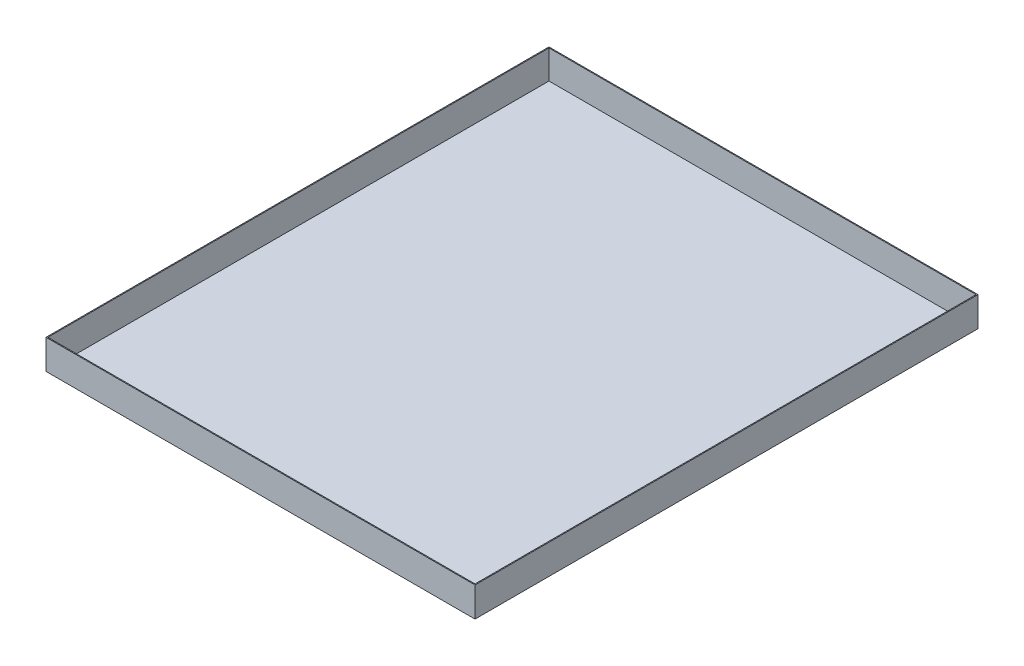
ISO-10303-21;
HEADER;
FILE_DESCRIPTION(('STEP AP214'),'2;1');
FILE_NAME('part.step','',(''),(''),'','','');
FILE_SCHEMA(('AUTOMOTIVE_DESIGN { 1 0 10303 214 1 1 1 1 }'));
ENDSEC;
DATA;
#1=APPLICATION_CONTEXT('core data for automotive mechanical design processes');
#2=APPLICATION_PROTOCOL_DEFINITION('international standard','automotive_design',2000,#1);
#3=PRODUCT_CONTEXT('',#1,'mechanical');
#4=PRODUCT('Part','Part','',(#3));
#5=PRODUCT_RELATED_PRODUCT_CATEGORY('part','',(#4));
#6=PRODUCT_DEFINITION_FORMATION('','',#4);
#7=PRODUCT_DEFINITION_CONTEXT('part definition',#1,'design');
#8=PRODUCT_DEFINITION('design','',#6,#7);
#9=PRODUCT_DEFINITION_SHAPE('','',#8);
#10=(LENGTH_UNIT() NAMED_UNIT(*) SI_UNIT(.MILLI.,.METRE.));
#11=(NAMED_UNIT(*) PLANE_ANGLE_UNIT() SI_UNIT($,.RADIAN.));
#12=(NAMED_UNIT(*) SI_UNIT($,.STERADIAN.) SOLID_ANGLE_UNIT());
#13=UNCERTAINTY_MEASURE_WITH_UNIT(LENGTH_MEASURE(1.E-05),#10,'distance_accuracy_value','');
#14=(GEOMETRIC_REPRESENTATION_CONTEXT(3) GLOBAL_UNCERTAINTY_ASSIGNED_CONTEXT((#13)) GLOBAL_UNIT_ASSIGNED_CONTEXT((#10,
#11,#12)) REPRESENTATION_CONTEXT('',''));
#15=CARTESIAN_POINT('',(0.,0.,0.));
#16=DIRECTION('',(0.,0.,1.));
#17=DIRECTION('',(1.,0.,0.));
#18=AXIS2_PLACEMENT_3D('',#15,#16,#17);
#19=CARTESIAN_POINT('',(0.,50.8,0.));
#20=DIRECTION('',(0.,-1.,0.));
#21=DIRECTION('',(0.,0.,-1.));
#22=AXIS2_PLACEMENT_3D('',#19,#20,#21);
#23=PLANE('',#22);
#24=DIRECTION('',(1.,0.,0.));
#25=VECTOR('',#24,1.);
#26=CARTESIAN_POINT('',(-368.3,50.8,431.8));
#27=LINE('',#26,#25);
#28=CARTESIAN_POINT('',(-368.3,50.8,431.8));
#29=VERTEX_POINT('',#28);
#30=CARTESIAN_POINT('',(368.3,50.8,431.8));
#31=VERTEX_POINT('',#30);
#32=EDGE_CURVE('E89',#29,#31,#27,.T.);
#33=ORIENTED_EDGE('',*,*,#32,.T.);
#34=DIRECTION('',(0.,0.,1.));
#35=VECTOR('',#34,1.);
#36=CARTESIAN_POINT('',(368.3,50.8,-431.8));
#37=LINE('',#36,#35);
#38=CARTESIAN_POINT('',(368.3,50.8,-431.8));
#39=VERTEX_POINT('',#38);
#40=EDGE_CURVE('E167',#39,#31,#37,.T.);
#41=ORIENTED_EDGE('',*,*,#40,.F.);
#42=DIRECTION('',(1.,0.,0.));
#43=VECTOR('',#42,1.);
#44=CARTESIAN_POINT('',(-368.3,50.8,-431.8));
#45=LINE('',#44,#43);
#46=CARTESIAN_POINT('',(-368.3,50.8,-431.8));
#47=VERTEX_POINT('',#46);
#48=EDGE_CURVE('E171',#47,#39,#45,.T.);
#49=ORIENTED_EDGE('',*,*,#48,.F.);
#50=DIRECTION('',(0.,0.,1.));
#51=VECTOR('',#50,1.);
#52=CARTESIAN_POINT('',(-368.3,50.8,-431.8));
#53=LINE('',#52,#51);
#54=EDGE_CURVE('E64',#47,#29,#53,.T.);
#55=ORIENTED_EDGE('',*,*,#54,.T.);
#56=EDGE_LOOP('',(#33,#41,#49,#55));
#57=FACE_BOUND('',#56,.T.);
#58=DIRECTION('',(1.,0.,0.));
#59=VECTOR('',#58,1.);
#60=CARTESIAN_POINT('',(0.,50.8,430.2125));
#61=LINE('',#60,#59);
#62=CARTESIAN_POINT('',(-366.7125,50.8,430.2125));
#63=VERTEX_POINT('',#62);
#64=CARTESIAN_POINT('',(366.7125,50.8,430.2125));
#65=VERTEX_POINT('',#64);
#66=EDGE_CURVE('E119',#63,#65,#61,.T.);
#67=ORIENTED_EDGE('',*,*,#66,.F.);
#68=DIRECTION('',(0.,0.,1.));
#69=VECTOR('',#68,1.);
#70=CARTESIAN_POINT('',(-366.7125,50.8,0.));
#71=LINE('',#70,#69);
#72=CARTESIAN_POINT('',(-366.7125,50.8,-430.2125));
#73=VERTEX_POINT('',#72);
#74=EDGE_CURVE('E162',#73,#63,#71,.T.);
#75=ORIENTED_EDGE('',*,*,#74,.F.);
#76=DIRECTION('',(1.,0.,0.));
#77=VECTOR('',#76,1.);
#78=CARTESIAN_POINT('',(0.,50.8,-430.2125));
#79=LINE('',#78,#77);
#80=CARTESIAN_POINT('',(366.7125,50.8,-430.2125));
#81=VERTEX_POINT('',#80);
#82=EDGE_CURVE('E55',#73,#81,#79,.T.);
#83=ORIENTED_EDGE('',*,*,#82,.T.);
#84=DIRECTION('',(0.,0.,1.));
#85=VECTOR('',#84,1.);
#86=CARTESIAN_POINT('',(366.7125,50.8,0.));
#87=LINE('',#86,#85);
#88=EDGE_CURVE('E157',#81,#65,#87,.T.);
#89=ORIENTED_EDGE('',*,*,#88,.T.);
#90=EDGE_LOOP('',(#67,#75,#83,#89));
#91=FACE_BOUND('',#90,.T.);
#92=ADVANCED_FACE('F39',(#57,#91),#23,.F.);
#93=CARTESIAN_POINT('',(-368.3,50.8,431.8));
#94=DIRECTION('',(0.,0.,-1.));
#95=DIRECTION('',(-1.,0.,0.));
#96=AXIS2_PLACEMENT_3D('',#93,#94,#95);
#97=PLANE('',#96);
#98=DIRECTION('',(1.,0.,0.));
#99=VECTOR('',#98,1.);
#100=CARTESIAN_POINT('',(-368.3,0.,431.8));
#101=LINE('',#100,#99);
#102=CARTESIAN_POINT('',(-368.3,0.,431.8));
#103=VERTEX_POINT('',#102);
#104=CARTESIAN_POINT('',(368.3,0.,431.8));
#105=VERTEX_POINT('',#104);
#106=EDGE_CURVE('E125',#103,#105,#101,.T.);
#107=ORIENTED_EDGE('',*,*,#106,.T.);
#108=DIRECTION('',(0.,-1.,0.));
#109=VECTOR('',#108,1.);
#110=CARTESIAN_POINT('',(368.3,50.8,431.8));
#111=LINE('',#110,#109);
#112=EDGE_CURVE('E11',#31,#105,#111,.T.);
#113=ORIENTED_EDGE('',*,*,#112,.F.);
#114=ORIENTED_EDGE('',*,*,#32,.F.);
#115=DIRECTION('',(0.,-1.,0.));
#116=VECTOR('',#115,1.);
#117=CARTESIAN_POINT('',(-368.3,50.8,431.8));
#118=LINE('',#117,#116);
#119=EDGE_CURVE('E177',#29,#103,#118,.T.);
#120=ORIENTED_EDGE('',*,*,#119,.T.);
#121=EDGE_LOOP('',(#107,#113,#114,#120));
#122=FACE_BOUND('',#121,.T.);
#123=ADVANCED_FACE('F41',(#122),#97,.F.);
#124=CARTESIAN_POINT('',(368.3,50.8,-431.8));
#125=DIRECTION('',(1.,0.,0.));
#126=DIRECTION('',(0.,0.,-1.));
#127=AXIS2_PLACEMENT_3D('',#124,#125,#126);
#128=PLANE('',#127);
#129=DIRECTION('',(0.,0.,1.));
#130=VECTOR('',#129,1.);
#131=CARTESIAN_POINT('',(368.3,0.,-431.8));
#132=LINE('',#131,#130);
#133=CARTESIAN_POINT('',(368.3,0.,-431.8));
#134=VERTEX_POINT('',#133);
#135=EDGE_CURVE('E181',#134,#105,#132,.T.);
#136=ORIENTED_EDGE('',*,*,#135,.F.);
#137=DIRECTION('',(0.,-1.,0.));
#138=VECTOR('',#137,1.);
#139=CARTESIAN_POINT('',(368.3,50.8,-431.8));
#140=LINE('',#139,#138);
#141=EDGE_CURVE('E48',#39,#134,#140,.T.);
#142=ORIENTED_EDGE('',*,*,#141,.F.);
#143=ORIENTED_EDGE('',*,*,#40,.T.);
#144=ORIENTED_EDGE('',*,*,#112,.T.);
#145=EDGE_LOOP('',(#136,#142,#143,#144));
#146=FACE_BOUND('',#145,.T.);
#147=ADVANCED_FACE('F201',(#146),#128,.T.);
#148=CARTESIAN_POINT('',(-368.3,50.8,-431.8));
#149=DIRECTION('',(0.,0.,-1.));
#150=DIRECTION('',(-1.,0.,0.));
#151=AXIS2_PLACEMENT_3D('',#148,#149,#150);
#152=PLANE('',#151);
#153=DIRECTION('',(1.,0.,0.));
#154=VECTOR('',#153,1.);
#155=CARTESIAN_POINT('',(-368.3,0.,-431.8));
#156=LINE('',#155,#154);
#157=CARTESIAN_POINT('',(-368.3,0.,-431.8));
#158=VERTEX_POINT('',#157);
#159=EDGE_CURVE('E185',#158,#134,#156,.T.);
#160=ORIENTED_EDGE('',*,*,#159,.F.);
#161=DIRECTION('',(0.,-1.,0.));
#162=VECTOR('',#161,1.);
#163=CARTESIAN_POINT('',(-368.3,50.8,-431.8));
#164=LINE('',#163,#162);
#165=EDGE_CURVE('E193',#47,#158,#164,.T.);
#166=ORIENTED_EDGE('',*,*,#165,.F.);
#167=ORIENTED_EDGE('',*,*,#48,.T.);
#168=ORIENTED_EDGE('',*,*,#141,.T.);
#169=EDGE_LOOP('',(#160,#166,#167,#168));
#170=FACE_BOUND('',#169,.T.);
#171=ADVANCED_FACE('F199',(#170),#152,.T.);
#172=CARTESIAN_POINT('',(-368.3,50.8,-431.8));
#173=DIRECTION('',(1.,0.,0.));
#174=DIRECTION('',(0.,0.,-1.));
#175=AXIS2_PLACEMENT_3D('',#172,#173,#174);
#176=PLANE('',#175);
#177=DIRECTION('',(0.,0.,1.));
#178=VECTOR('',#177,1.);
#179=CARTESIAN_POINT('',(-368.3,0.,-431.8));
#180=LINE('',#179,#178);
#181=EDGE_CURVE('E84',#158,#103,#180,.T.);
#182=ORIENTED_EDGE('',*,*,#181,.T.);
#183=ORIENTED_EDGE('',*,*,#119,.F.);
#184=ORIENTED_EDGE('',*,*,#54,.F.);
#185=ORIENTED_EDGE('',*,*,#165,.T.);
#186=EDGE_LOOP('',(#182,#183,#184,#185));
#187=FACE_BOUND('',#186,.T.);
#188=ADVANCED_FACE('F206',(#187),#176,.F.);
#189=CARTESIAN_POINT('',(0.,0.,0.));
#190=DIRECTION('',(0.,-1.,0.));
#191=DIRECTION('',(0.,0.,-1.));
#192=AXIS2_PLACEMENT_3D('',#189,#190,#191);
#193=PLANE('',#192);
#194=ORIENTED_EDGE('',*,*,#106,.F.);
#195=ORIENTED_EDGE('',*,*,#181,.F.);
#196=ORIENTED_EDGE('',*,*,#159,.T.);
#197=ORIENTED_EDGE('',*,*,#135,.T.);
#198=EDGE_LOOP('',(#194,#195,#196,#197));
#199=FACE_BOUND('',#198,.T.);
#200=ADVANCED_FACE('F204',(#199),#193,.T.);
#201=CARTESIAN_POINT('',(-368.3,50.8,430.2125));
#202=DIRECTION('',(0.,0.,-1.));
#203=DIRECTION('',(-1.,0.,0.));
#204=AXIS2_PLACEMENT_3D('',#201,#202,#203);
#205=PLANE('',#204);
#206=DIRECTION('',(1.,0.,0.));
#207=VECTOR('',#206,1.);
#208=CARTESIAN_POINT('',(0.,1.5875,430.2125));
#209=LINE('',#208,#207);
#210=CARTESIAN_POINT('',(-366.7125,1.5875,430.2125));
#211=VERTEX_POINT('',#210);
#212=CARTESIAN_POINT('',(366.7125,1.5875,430.2125));
#213=VERTEX_POINT('',#212);
#214=EDGE_CURVE('E117',#211,#213,#209,.T.);
#215=ORIENTED_EDGE('',*,*,#214,.F.);
#216=DIRECTION('',(0.,-1.,0.));
#217=VECTOR('',#216,1.);
#218=CARTESIAN_POINT('',(-366.7125,50.8,430.2125));
#219=LINE('',#218,#217);
#220=EDGE_CURVE('E147',#63,#211,#219,.T.);
#221=ORIENTED_EDGE('',*,*,#220,.F.);
#222=ORIENTED_EDGE('',*,*,#66,.T.);
#223=DIRECTION('',(0.,-1.,0.));
#224=VECTOR('',#223,1.);
#225=CARTESIAN_POINT('',(366.7125,50.8,430.2125));
#226=LINE('',#225,#224);
#227=EDGE_CURVE('E113',#65,#213,#226,.T.);
#228=ORIENTED_EDGE('',*,*,#227,.T.);
#229=EDGE_LOOP('',(#215,#221,#222,#228));
#230=FACE_BOUND('',#229,.T.);
#231=ADVANCED_FACE('F115',(#230),#205,.T.);
#232=CARTESIAN_POINT('',(366.7125,50.8,-431.8));
#233=DIRECTION('',(1.,0.,0.));
#234=DIRECTION('',(0.,0.,-1.));
#235=AXIS2_PLACEMENT_3D('',#232,#233,#234);
#236=PLANE('',#235);
#237=DIRECTION('',(0.,0.,1.));
#238=VECTOR('',#237,1.);
#239=CARTESIAN_POINT('',(366.7125,1.5875,0.));
#240=LINE('',#239,#238);
#241=CARTESIAN_POINT('',(366.7125,1.5875,-430.2125));
#242=VERTEX_POINT('',#241);
#243=EDGE_CURVE('E132',#242,#213,#240,.T.);
#244=ORIENTED_EDGE('',*,*,#243,.T.);
#245=ORIENTED_EDGE('',*,*,#227,.F.);
#246=ORIENTED_EDGE('',*,*,#88,.F.);
#247=DIRECTION('',(0.,-1.,0.));
#248=VECTOR('',#247,1.);
#249=CARTESIAN_POINT('',(366.7125,50.8,-430.2125));
#250=LINE('',#249,#248);
#251=EDGE_CURVE('E126',#81,#242,#250,.T.);
#252=ORIENTED_EDGE('',*,*,#251,.T.);
#253=EDGE_LOOP('',(#244,#245,#246,#252));
#254=FACE_BOUND('',#253,.T.);
#255=ADVANCED_FACE('F139',(#254),#236,.F.);
#256=CARTESIAN_POINT('',(-368.3,50.8,-430.2125));
#257=DIRECTION('',(0.,0.,-1.));
#258=DIRECTION('',(-1.,0.,0.));
#259=AXIS2_PLACEMENT_3D('',#256,#257,#258);
#260=PLANE('',#259);
#261=DIRECTION('',(1.,0.,0.));
#262=VECTOR('',#261,1.);
#263=CARTESIAN_POINT('',(0.,1.5875,-430.2125));
#264=LINE('',#263,#262);
#265=CARTESIAN_POINT('',(-366.7125,1.5875,-430.2125));
#266=VERTEX_POINT('',#265);
#267=EDGE_CURVE('E141',#266,#242,#264,.T.);
#268=ORIENTED_EDGE('',*,*,#267,.T.);
#269=ORIENTED_EDGE('',*,*,#251,.F.);
#270=ORIENTED_EDGE('',*,*,#82,.F.);
#271=DIRECTION('',(0.,-1.,0.));
#272=VECTOR('',#271,1.);
#273=CARTESIAN_POINT('',(-366.7125,50.8,-430.2125));
#274=LINE('',#273,#272);
#275=EDGE_CURVE('E149',#73,#266,#274,.T.);
#276=ORIENTED_EDGE('',*,*,#275,.T.);
#277=EDGE_LOOP('',(#268,#269,#270,#276));
#278=FACE_BOUND('',#277,.T.);
#279=ADVANCED_FACE('F214',(#278),#260,.F.);
#280=CARTESIAN_POINT('',(-366.7125,50.8,-431.8));
#281=DIRECTION('',(1.,0.,0.));
#282=DIRECTION('',(0.,0.,-1.));
#283=AXIS2_PLACEMENT_3D('',#280,#281,#282);
#284=PLANE('',#283);
#285=DIRECTION('',(0.,0.,1.));
#286=VECTOR('',#285,1.);
#287=CARTESIAN_POINT('',(-366.7125,1.5875,0.));
#288=LINE('',#287,#286);
#289=EDGE_CURVE('E135',#266,#211,#288,.T.);
#290=ORIENTED_EDGE('',*,*,#289,.F.);
#291=ORIENTED_EDGE('',*,*,#275,.F.);
#292=ORIENTED_EDGE('',*,*,#74,.T.);
#293=ORIENTED_EDGE('',*,*,#220,.T.);
#294=EDGE_LOOP('',(#290,#291,#292,#293));
#295=FACE_BOUND('',#294,.T.);
#296=ADVANCED_FACE('F212',(#295),#284,.T.);
#297=CARTESIAN_POINT('',(0.,1.5875,0.));
#298=DIRECTION('',(0.,-1.,0.));
#299=DIRECTION('',(0.,0.,-1.));
#300=AXIS2_PLACEMENT_3D('',#297,#298,#299);
#301=PLANE('',#300);
#302=ORIENTED_EDGE('',*,*,#214,.T.);
#303=ORIENTED_EDGE('',*,*,#243,.F.);
#304=ORIENTED_EDGE('',*,*,#267,.F.);
#305=ORIENTED_EDGE('',*,*,#289,.T.);
#306=EDGE_LOOP('',(#302,#303,#304,#305));
#307=FACE_BOUND('',#306,.T.);
#308=ADVANCED_FACE('F130',(#307),#301,.F.);
#309=CLOSED_SHELL('',(#92,#123,#147,#171,#188,#200,#231,#255,#279,#296,#308));
#310=MANIFOLD_SOLID_BREP('B2',#309);
#311=ADVANCED_BREP_SHAPE_REPRESENTATION('',(#18,#310),#14);
#312=SHAPE_DEFINITION_REPRESENTATION(#9,#311);
ENDSEC;
END-ISO-10303-21;
